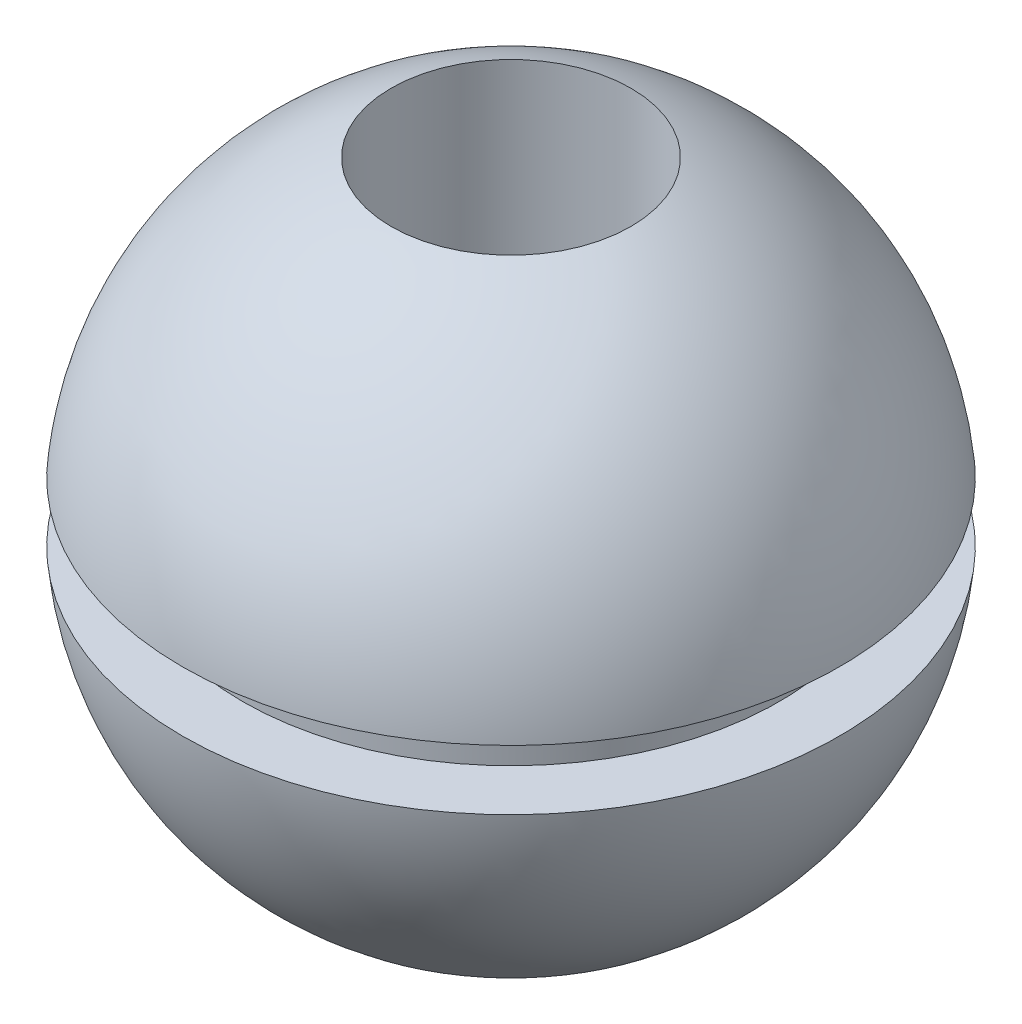
ISO-10303-21;
HEADER;
FILE_DESCRIPTION(('STEP AP214'),'2;1');
FILE_NAME('part.step','',(''),(''),'','','');
FILE_SCHEMA(('AUTOMOTIVE_DESIGN { 1 0 10303 214 1 1 1 1 }'));
ENDSEC;
DATA;
#1=APPLICATION_CONTEXT('core data for automotive mechanical design processes');
#2=APPLICATION_PROTOCOL_DEFINITION('international standard','automotive_design',2000,#1);
#3=PRODUCT_CONTEXT('',#1,'mechanical');
#4=PRODUCT('Part','Part','',(#3));
#5=PRODUCT_RELATED_PRODUCT_CATEGORY('part','',(#4));
#6=PRODUCT_DEFINITION_FORMATION('','',#4);
#7=PRODUCT_DEFINITION_CONTEXT('part definition',#1,'design');
#8=PRODUCT_DEFINITION('design','',#6,#7);
#9=PRODUCT_DEFINITION_SHAPE('','',#8);
#10=(LENGTH_UNIT() NAMED_UNIT(*) SI_UNIT(.MILLI.,.METRE.));
#11=(NAMED_UNIT(*) PLANE_ANGLE_UNIT() SI_UNIT($,.RADIAN.));
#12=(NAMED_UNIT(*) SI_UNIT($,.STERADIAN.) SOLID_ANGLE_UNIT());
#13=UNCERTAINTY_MEASURE_WITH_UNIT(LENGTH_MEASURE(1.E-05),#10,'distance_accuracy_value','');
#14=(GEOMETRIC_REPRESENTATION_CONTEXT(3) GLOBAL_UNCERTAINTY_ASSIGNED_CONTEXT((#13)) GLOBAL_UNIT_ASSIGNED_CONTEXT((#10,
#11,#12)) REPRESENTATION_CONTEXT('',''));
#15=CARTESIAN_POINT('',(0.,0.,0.));
#16=DIRECTION('',(0.,0.,1.));
#17=DIRECTION('',(1.,0.,0.));
#18=AXIS2_PLACEMENT_3D('',#15,#16,#17);
#19=CARTESIAN_POINT('',(0.,11.,0.));
#20=DIRECTION('',(0.,-1.,0.));
#21=DIRECTION('',(-1.,0.,0.));
#22=AXIS2_PLACEMENT_3D('',#19,#20,#21);
#23=SPHERICAL_SURFACE('',#22,11.);
#24=CARTESIAN_POINT('',(0.,10.,0.));
#25=DIRECTION('',(0.,-1.,0.));
#26=DIRECTION('',(0.,0.,-1.));
#27=AXIS2_PLACEMENT_3D('',#24,#25,#26);
#28=CIRCLE('',#27,10.9544511501033);
#29=CARTESIAN_POINT('',(0.,10.,-10.9544511501033));
#30=VERTEX_POINT('',#29);
#31=EDGE_CURVE('E46',#30,#30,#28,.T.);
#32=ORIENTED_EDGE('',*,*,#31,.T.);
#33=EDGE_LOOP('',(#32));
#34=FACE_BOUND('',#33,.T.);
#35=CARTESIAN_POINT('',(0.,0.753049234040402,0.));
#36=DIRECTION('',(0.,1.,0.));
#37=DIRECTION('',(0.,0.,1.));
#38=AXIS2_PLACEMENT_3D('',#35,#36,#37);
#39=CIRCLE('',#38,4.);
#40=CARTESIAN_POINT('',(0.,0.753049234040402,4.));
#41=VERTEX_POINT('',#40);
#42=EDGE_CURVE('E49',#41,#41,#39,.T.);
#43=ORIENTED_EDGE('',*,*,#42,.T.);
#44=EDGE_LOOP('',(#43));
#45=FACE_BOUND('',#44,.T.);
#46=ADVANCED_FACE('F30',(#34,#45),#23,.T.);
#47=CARTESIAN_POINT('',(0.,11.,0.));
#48=DIRECTION('',(0.,-1.,0.));
#49=DIRECTION('',(1.,0.,0.));
#50=AXIS2_PLACEMENT_3D('',#47,#48,#49);
#51=SPHERICAL_SURFACE('',#50,11.);
#52=CARTESIAN_POINT('',(0.,12.,0.));
#53=DIRECTION('',(0.,-1.,0.));
#54=DIRECTION('',(0.,0.,-1.));
#55=AXIS2_PLACEMENT_3D('',#52,#53,#54);
#56=CIRCLE('',#55,10.9544511501033);
#57=CARTESIAN_POINT('',(0.,12.,-10.9544511501033));
#58=VERTEX_POINT('',#57);
#59=EDGE_CURVE('E10',#58,#58,#56,.T.);
#60=ORIENTED_EDGE('',*,*,#59,.F.);
#61=EDGE_LOOP('',(#60));
#62=FACE_BOUND('',#61,.T.);
#63=CARTESIAN_POINT('',(0.,21.2469507659596,0.));
#64=DIRECTION('',(0.,-1.,0.));
#65=DIRECTION('',(0.,0.,-1.));
#66=AXIS2_PLACEMENT_3D('',#63,#64,#65);
#67=CIRCLE('',#66,4.);
#68=CARTESIAN_POINT('',(0.,21.2469507659596,-4.));
#69=VERTEX_POINT('',#68);
#70=EDGE_CURVE('E33',#69,#69,#67,.T.);
#71=ORIENTED_EDGE('',*,*,#70,.T.);
#72=EDGE_LOOP('',(#71));
#73=FACE_BOUND('',#72,.T.);
#74=ADVANCED_FACE('F56',(#62,#73),#51,.T.);
#75=CARTESIAN_POINT('',(8.95445115010332,12.,0.));
#76=DIRECTION('',(0.,-1.,0.));
#77=DIRECTION('',(0.,0.,-1.));
#78=AXIS2_PLACEMENT_3D('',#75,#76,#77);
#79=PLANE('',#78);
#80=ORIENTED_EDGE('',*,*,#59,.T.);
#81=EDGE_LOOP('',(#80));
#82=FACE_BOUND('',#81,.T.);
#83=CARTESIAN_POINT('',(0.,12.,0.));
#84=DIRECTION('',(0.,-1.,0.));
#85=DIRECTION('',(0.,0.,-1.));
#86=AXIS2_PLACEMENT_3D('',#83,#84,#85);
#87=CIRCLE('',#86,8.95445115010332);
#88=CARTESIAN_POINT('',(0.,12.,-8.95445115010332));
#89=VERTEX_POINT('',#88);
#90=EDGE_CURVE('E37',#89,#89,#87,.T.);
#91=ORIENTED_EDGE('',*,*,#90,.F.);
#92=EDGE_LOOP('',(#91));
#93=FACE_BOUND('',#92,.T.);
#94=ADVANCED_FACE('F74',(#82,#93),#79,.T.);
#95=CARTESIAN_POINT('',(0.,0.,0.));
#96=DIRECTION('',(0.,-1.,0.));
#97=DIRECTION('',(0.,0.,-1.));
#98=AXIS2_PLACEMENT_3D('',#95,#96,#97);
#99=CYLINDRICAL_SURFACE('',#98,8.95445115010332);
#100=ORIENTED_EDGE('',*,*,#90,.T.);
#101=EDGE_LOOP('',(#100));
#102=FACE_BOUND('',#101,.T.);
#103=CARTESIAN_POINT('',(0.,10.,0.));
#104=DIRECTION('',(0.,-1.,0.));
#105=DIRECTION('',(0.,0.,-1.));
#106=AXIS2_PLACEMENT_3D('',#103,#104,#105);
#107=CIRCLE('',#106,8.95445115010332);
#108=CARTESIAN_POINT('',(0.,10.,-8.95445115010332));
#109=VERTEX_POINT('',#108);
#110=EDGE_CURVE('E41',#109,#109,#107,.T.);
#111=ORIENTED_EDGE('',*,*,#110,.F.);
#112=EDGE_LOOP('',(#111));
#113=FACE_BOUND('',#112,.T.);
#114=ADVANCED_FACE('F66',(#102,#113),#99,.T.);
#115=CARTESIAN_POINT('',(8.95445115010332,10.,0.));
#116=DIRECTION('',(0.,1.,0.));
#117=DIRECTION('',(0.,0.,1.));
#118=AXIS2_PLACEMENT_3D('',#115,#116,#117);
#119=PLANE('',#118);
#120=ORIENTED_EDGE('',*,*,#110,.T.);
#121=EDGE_LOOP('',(#120));
#122=FACE_BOUND('',#121,.T.);
#123=ORIENTED_EDGE('',*,*,#31,.F.);
#124=EDGE_LOOP('',(#123));
#125=FACE_BOUND('',#124,.T.);
#126=ADVANCED_FACE('F60',(#122,#125),#119,.T.);
#127=CARTESIAN_POINT('',(0.,22.,0.));
#128=DIRECTION('',(0.,-1.,0.));
#129=DIRECTION('',(0.,0.,-1.));
#130=AXIS2_PLACEMENT_3D('',#127,#128,#129);
#131=CYLINDRICAL_SURFACE('',#130,4.);
#132=ORIENTED_EDGE('',*,*,#42,.F.);
#133=EDGE_LOOP('',(#132));
#134=FACE_BOUND('',#133,.T.);
#135=ORIENTED_EDGE('',*,*,#70,.F.);
#136=EDGE_LOOP('',(#135));
#137=FACE_BOUND('',#136,.T.);
#138=ADVANCED_FACE('F58',(#134,#137),#131,.F.);
#139=CLOSED_SHELL('',(#46,#74,#94,#114,#126,#138));
#140=MANIFOLD_SOLID_BREP('B2',#139);
#141=ADVANCED_BREP_SHAPE_REPRESENTATION('',(#18,#140),#14);
#142=SHAPE_DEFINITION_REPRESENTATION(#9,#141);
ENDSEC;
END-ISO-10303-21;
